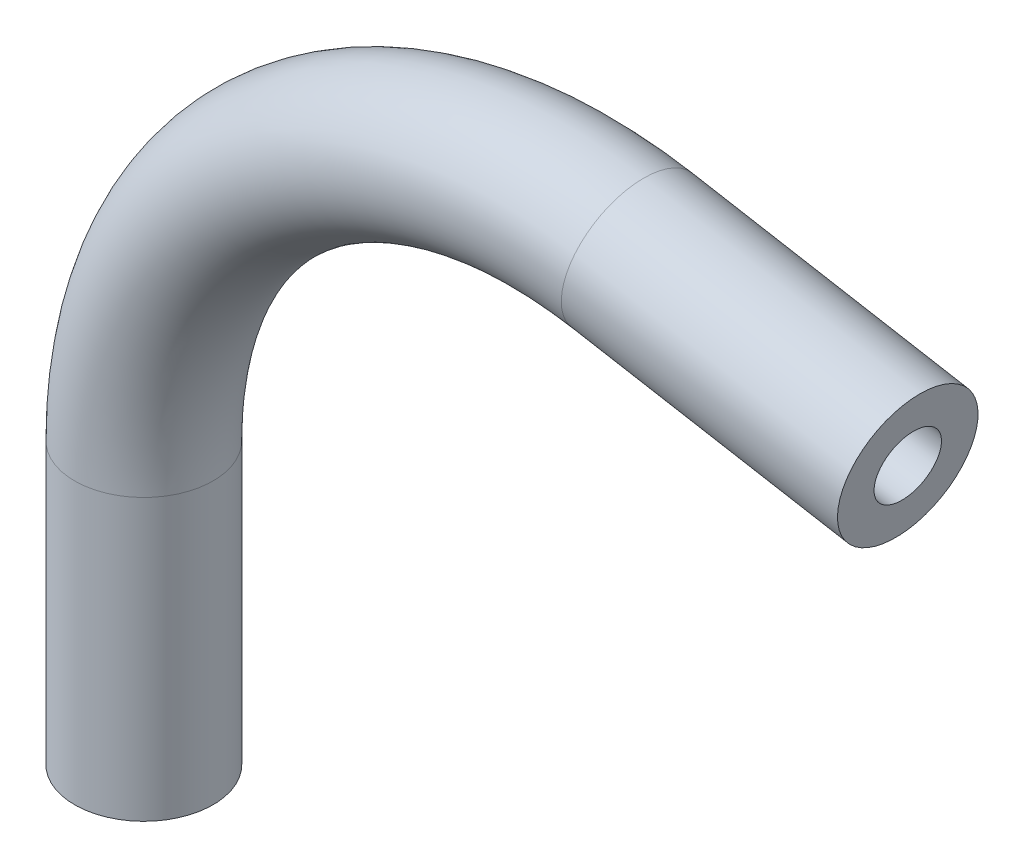
ISO-10303-21;
HEADER;
FILE_DESCRIPTION(('STEP AP214'),'2;1');
FILE_NAME('part.step','',(''),(''),'','','');
FILE_SCHEMA(('AUTOMOTIVE_DESIGN { 1 0 10303 214 1 1 1 1 }'));
ENDSEC;
DATA;
#1=APPLICATION_CONTEXT('core data for automotive mechanical design processes');
#2=APPLICATION_PROTOCOL_DEFINITION('international standard','automotive_design',2000,#1);
#3=PRODUCT_CONTEXT('',#1,'mechanical');
#4=PRODUCT('Part','Part','',(#3));
#5=PRODUCT_RELATED_PRODUCT_CATEGORY('part','',(#4));
#6=PRODUCT_DEFINITION_FORMATION('','',#4);
#7=PRODUCT_DEFINITION_CONTEXT('part definition',#1,'design');
#8=PRODUCT_DEFINITION('design','',#6,#7);
#9=PRODUCT_DEFINITION_SHAPE('','',#8);
#10=(LENGTH_UNIT() NAMED_UNIT(*) SI_UNIT(.MILLI.,.METRE.));
#11=(NAMED_UNIT(*) PLANE_ANGLE_UNIT() SI_UNIT($,.RADIAN.));
#12=(NAMED_UNIT(*) SI_UNIT($,.STERADIAN.) SOLID_ANGLE_UNIT());
#13=UNCERTAINTY_MEASURE_WITH_UNIT(LENGTH_MEASURE(1.E-05),#10,'distance_accuracy_value','');
#14=(GEOMETRIC_REPRESENTATION_CONTEXT(3) GLOBAL_UNCERTAINTY_ASSIGNED_CONTEXT((#13)) GLOBAL_UNIT_ASSIGNED_CONTEXT((#10,
#11,#12)) REPRESENTATION_CONTEXT('',''));
#15=CARTESIAN_POINT('',(0.,0.,0.));
#16=DIRECTION('',(0.,0.,1.));
#17=DIRECTION('',(1.,0.,0.));
#18=AXIS2_PLACEMENT_3D('',#15,#16,#17);
#19=CARTESIAN_POINT('',(0.,-14.3794119418749,0.));
#20=DIRECTION('',(0.,1.,0.));
#21=DIRECTION('',(-1.,0.,0.));
#22=AXIS2_PLACEMENT_3D('',#19,#20,#21);
#23=CYLINDRICAL_SURFACE('',#22,3.175);
#24=CARTESIAN_POINT('',(0.,-1.52231788079481,0.));
#25=DIRECTION('',(0.,1.,0.));
#26=DIRECTION('',(-1.,0.,0.));
#27=AXIS2_PLACEMENT_3D('',#24,#25,#26);
#28=CIRCLE('',#27,3.175);
#29=CARTESIAN_POINT('',(-3.17500000000001,-1.52231788079483,0.));
#30=VERTEX_POINT('',#29);
#31=EDGE_CURVE('E80',#30,#30,#28,.T.);
#32=ORIENTED_EDGE('',*,*,#31,.F.);
#33=EDGE_LOOP('',(#32));
#34=FACE_BOUND('',#33,.T.);
#35=CARTESIAN_POINT('',(0.,-14.3794119418749,0.));
#36=DIRECTION('',(0.,1.,0.));
#37=DIRECTION('',(-1.,0.,0.));
#38=AXIS2_PLACEMENT_3D('',#35,#36,#37);
#39=CIRCLE('',#38,3.175);
#40=CARTESIAN_POINT('',(-3.17500000000001,-14.3794119418749,0.));
#41=VERTEX_POINT('',#40);
#42=EDGE_CURVE('E49',#41,#41,#39,.T.);
#43=ORIENTED_EDGE('',*,*,#42,.T.);
#44=EDGE_LOOP('',(#43));
#45=FACE_BOUND('',#44,.T.);
#46=ADVANCED_FACE('F34',(#34,#45),#23,.T.);
#47=CARTESIAN_POINT('',(19.05,-1.52231788079469,0.));
#48=DIRECTION('',(0.,0.,-1.));
#49=DIRECTION('',(-1.,0.,0.));
#50=AXIS2_PLACEMENT_3D('',#47,#48,#49);
#51=TOROIDAL_SURFACE('',#50,19.05,3.175);
#52=CARTESIAN_POINT('',(22.3579977845551,17.2382698140878,0.));
#53=DIRECTION('',(0.984807753012207,-0.173648177666934,0.));
#54=DIRECTION('',(0.173648177666934,0.984807753012208,0.));
#55=AXIS2_PLACEMENT_3D('',#52,#53,#54);
#56=CIRCLE('',#55,3.175);
#57=CARTESIAN_POINT('',(22.9093307486476,20.3650344299016,0.));
#58=VERTEX_POINT('',#57);
#59=EDGE_CURVE('E38',#58,#58,#56,.T.);
#60=CARTESIAN_POINT('',(19.05,-1.52231788079469,0.));
#61=DIRECTION('',(0.,0.,-1.));
#62=DIRECTION('',(-1.,0.,0.));
#63=AXIS2_PLACEMENT_3D('',#60,#61,#62);
#64=CIRCLE('',#63,22.225);
#65=EDGE_CURVE('',#30,#58,#64,.T.);
#66=ORIENTED_EDGE('',*,*,#31,.T.);
#67=ORIENTED_EDGE('',*,*,#59,.F.);
#68=ORIENTED_EDGE('',*,*,#65,.T.);
#69=ORIENTED_EDGE('',*,*,#65,.F.);
#70=EDGE_LOOP('',(#66,#68,#67,#69));
#71=FACE_BOUND('',#70,.T.);
#72=ADVANCED_FACE('F88',(#71),#51,.T.);
#73=CARTESIAN_POINT('',(22.3579977845551,17.2382698140879,0.));
#74=DIRECTION('',(0.984807753012207,-0.173648177666934,0.));
#75=DIRECTION('',(0.173648177666934,0.984807753012208,0.));
#76=AXIS2_PLACEMENT_3D('',#73,#74,#75);
#77=CYLINDRICAL_SURFACE('',#76,3.175);
#78=CARTESIAN_POINT('',(35.0197636971141,15.0056588602889,0.));
#79=DIRECTION('',(0.984807753012207,-0.173648177666934,0.));
#80=DIRECTION('',(0.173648177666934,0.984807753012208,0.));
#81=AXIS2_PLACEMENT_3D('',#78,#79,#80);
#82=CIRCLE('',#81,3.175);
#83=CARTESIAN_POINT('',(35.5710966612066,18.1324234761027,0.));
#84=VERTEX_POINT('',#83);
#85=EDGE_CURVE('E54',#84,#84,#82,.T.);
#86=ORIENTED_EDGE('',*,*,#85,.F.);
#87=EDGE_LOOP('',(#86));
#88=FACE_BOUND('',#87,.T.);
#89=ORIENTED_EDGE('',*,*,#59,.T.);
#90=EDGE_LOOP('',(#89));
#91=FACE_BOUND('',#90,.T.);
#92=ADVANCED_FACE('F36',(#88,#91),#77,.T.);
#93=CARTESIAN_POINT('',(0.,-14.3794119418749,0.));
#94=DIRECTION('',(0.,1.,0.));
#95=DIRECTION('',(-1.,0.,0.));
#96=AXIS2_PLACEMENT_3D('',#93,#94,#95);
#97=PLANE('',#96);
#98=CARTESIAN_POINT('',(0.,-14.3794119418749,0.));
#99=DIRECTION('',(0.,1.,0.));
#100=DIRECTION('',(-1.,0.,0.));
#101=AXIS2_PLACEMENT_3D('',#98,#99,#100);
#102=CIRCLE('',#101,1.524);
#103=CARTESIAN_POINT('',(-1.52400000000001,-14.3794119418749,0.));
#104=VERTEX_POINT('',#103);
#105=EDGE_CURVE('E75',#104,#104,#102,.F.);
#106=ORIENTED_EDGE('',*,*,#105,.F.);
#107=EDGE_LOOP('',(#106));
#108=FACE_BOUND('',#107,.T.);
#109=ORIENTED_EDGE('',*,*,#42,.F.);
#110=EDGE_LOOP('',(#109));
#111=FACE_BOUND('',#110,.T.);
#112=ADVANCED_FACE('F94',(#108,#111),#97,.F.);
#113=CARTESIAN_POINT('',(35.0197636971141,15.0056588602889,0.));
#114=DIRECTION('',(0.984807753012207,-0.173648177666934,0.));
#115=DIRECTION('',(0.173648177666934,0.984807753012208,0.));
#116=AXIS2_PLACEMENT_3D('',#113,#114,#115);
#117=PLANE('',#116);
#118=CARTESIAN_POINT('',(35.0197636971141,15.0056588602889,0.));
#119=DIRECTION('',(0.984807753012207,-0.173648177666934,0.));
#120=DIRECTION('',(0.173648177666934,0.984807753012208,0.));
#121=AXIS2_PLACEMENT_3D('',#118,#119,#120);
#122=CIRCLE('',#121,1.524);
#123=CARTESIAN_POINT('',(35.2844035198785,16.5065058758795,0.));
#124=VERTEX_POINT('',#123);
#125=EDGE_CURVE('E11',#124,#124,#122,.F.);
#126=ORIENTED_EDGE('',*,*,#125,.T.);
#127=EDGE_LOOP('',(#126));
#128=FACE_BOUND('',#127,.T.);
#129=ORIENTED_EDGE('',*,*,#85,.T.);
#130=EDGE_LOOP('',(#129));
#131=FACE_BOUND('',#130,.T.);
#132=ADVANCED_FACE('F61',(#128,#131),#117,.T.);
#133=CARTESIAN_POINT('',(0.,-14.3794119418749,0.));
#134=DIRECTION('',(0.,1.,0.));
#135=DIRECTION('',(-1.,0.,0.));
#136=AXIS2_PLACEMENT_3D('',#133,#134,#135);
#137=CYLINDRICAL_SURFACE('',#136,1.524);
#138=CARTESIAN_POINT('',(0.,-1.52231788079481,0.));
#139=DIRECTION('',(0.,1.,0.));
#140=DIRECTION('',(-1.,0.,0.));
#141=AXIS2_PLACEMENT_3D('',#138,#139,#140);
#142=CIRCLE('',#141,1.524);
#143=CARTESIAN_POINT('',(-1.52400000000001,-1.52231788079482,0.));
#144=VERTEX_POINT('',#143);
#145=EDGE_CURVE('E72',#144,#144,#142,.F.);
#146=ORIENTED_EDGE('',*,*,#145,.F.);
#147=EDGE_LOOP('',(#146));
#148=FACE_BOUND('',#147,.T.);
#149=ORIENTED_EDGE('',*,*,#105,.T.);
#150=EDGE_LOOP('',(#149));
#151=FACE_BOUND('',#150,.T.);
#152=ADVANCED_FACE('F102',(#148,#151),#137,.F.);
#153=CARTESIAN_POINT('',(19.05,-1.52231788079469,0.));
#154=DIRECTION('',(0.,0.,-1.));
#155=DIRECTION('',(-1.,0.,0.));
#156=AXIS2_PLACEMENT_3D('',#153,#154,#155);
#157=TOROIDAL_SURFACE('',#156,19.05,1.524);
#158=CARTESIAN_POINT('',(22.3579977845551,17.2382698140878,0.));
#159=DIRECTION('',(0.984807753012207,-0.173648177666934,0.));
#160=DIRECTION('',(0.173648177666934,0.984807753012208,0.));
#161=AXIS2_PLACEMENT_3D('',#158,#159,#160);
#162=CIRCLE('',#161,1.524);
#163=CARTESIAN_POINT('',(22.6226376073195,18.7391168296785,0.));
#164=VERTEX_POINT('',#163);
#165=EDGE_CURVE('E43',#164,#164,#162,.F.);
#166=CARTESIAN_POINT('',(19.05,-1.52231788079469,0.));
#167=DIRECTION('',(0.,0.,-1.));
#168=DIRECTION('',(-1.,0.,0.));
#169=AXIS2_PLACEMENT_3D('',#166,#167,#168);
#170=CIRCLE('',#169,20.574);
#171=EDGE_CURVE('',#144,#164,#170,.T.);
#172=ORIENTED_EDGE('',*,*,#145,.T.);
#173=ORIENTED_EDGE('',*,*,#165,.F.);
#174=ORIENTED_EDGE('',*,*,#171,.T.);
#175=ORIENTED_EDGE('',*,*,#171,.F.);
#176=EDGE_LOOP('',(#172,#174,#173,#175));
#177=FACE_BOUND('',#176,.T.);
#178=ADVANCED_FACE('F67',(#177),#157,.F.);
#179=CARTESIAN_POINT('',(22.3579977845551,17.2382698140879,0.));
#180=DIRECTION('',(0.984807753012207,-0.173648177666934,0.));
#181=DIRECTION('',(0.173648177666934,0.984807753012208,0.));
#182=AXIS2_PLACEMENT_3D('',#179,#180,#181);
#183=CYLINDRICAL_SURFACE('',#182,1.524);
#184=ORIENTED_EDGE('',*,*,#125,.F.);
#185=EDGE_LOOP('',(#184));
#186=FACE_BOUND('',#185,.T.);
#187=ORIENTED_EDGE('',*,*,#165,.T.);
#188=EDGE_LOOP('',(#187));
#189=FACE_BOUND('',#188,.T.);
#190=ADVANCED_FACE('F64',(#186,#189),#183,.F.);
#191=CLOSED_SHELL('',(#46,#72,#92,#112,#132,#152,#178,#190));
#192=MANIFOLD_SOLID_BREP('B2',#191);
#193=ADVANCED_BREP_SHAPE_REPRESENTATION('',(#18,#192),#14);
#194=SHAPE_DEFINITION_REPRESENTATION(#9,#193);
ENDSEC;
END-ISO-10303-21;
